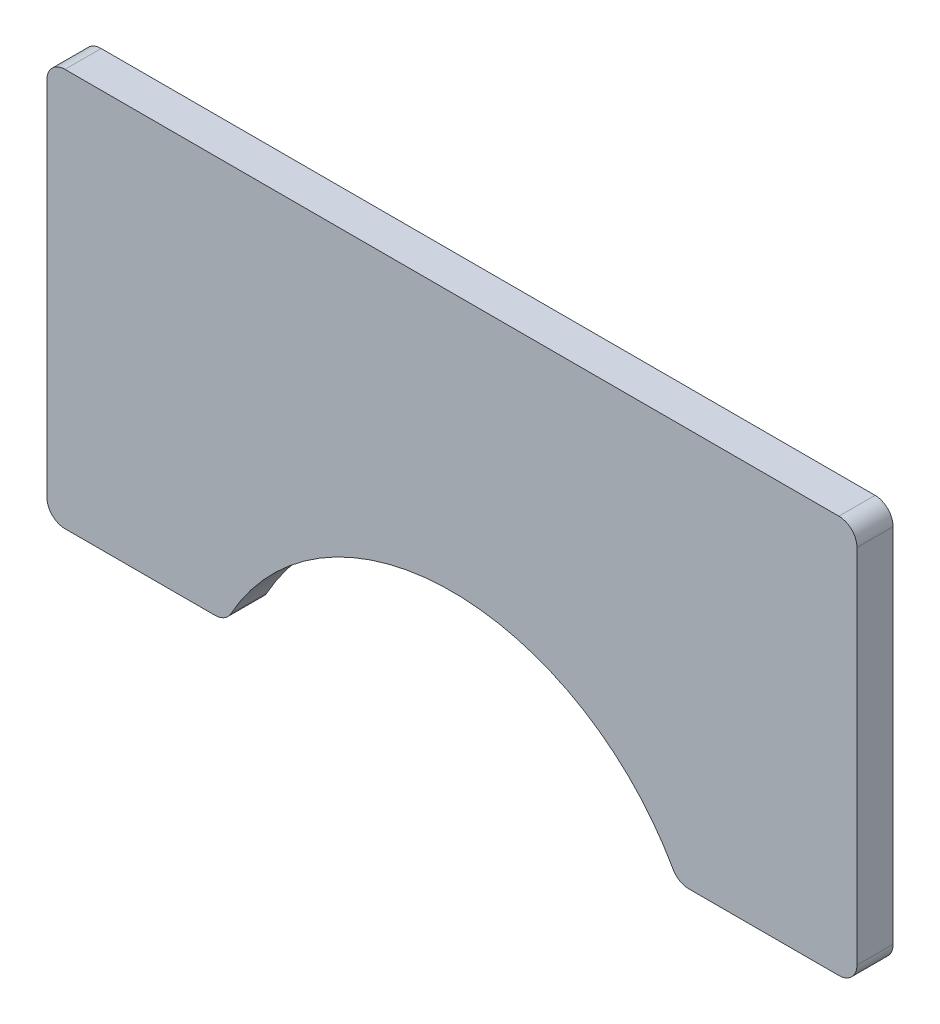
ISO-10303-21;
HEADER;
FILE_DESCRIPTION(('STEP AP214'),'2;1');
FILE_NAME('part.step','',(''),(''),'','','');
FILE_SCHEMA(('AUTOMOTIVE_DESIGN { 1 0 10303 214 1 1 1 1 }'));
ENDSEC;
DATA;
#1=APPLICATION_CONTEXT('core data for automotive mechanical design processes');
#2=APPLICATION_PROTOCOL_DEFINITION('international standard','automotive_design',2000,#1);
#3=PRODUCT_CONTEXT('',#1,'mechanical');
#4=PRODUCT('Part','Part','',(#3));
#5=PRODUCT_RELATED_PRODUCT_CATEGORY('part','',(#4));
#6=PRODUCT_DEFINITION_FORMATION('','',#4);
#7=PRODUCT_DEFINITION_CONTEXT('part definition',#1,'design');
#8=PRODUCT_DEFINITION('design','',#6,#7);
#9=PRODUCT_DEFINITION_SHAPE('','',#8);
#10=(LENGTH_UNIT() NAMED_UNIT(*) SI_UNIT(.MILLI.,.METRE.));
#11=(NAMED_UNIT(*) PLANE_ANGLE_UNIT() SI_UNIT($,.RADIAN.));
#12=(NAMED_UNIT(*) SI_UNIT($,.STERADIAN.) SOLID_ANGLE_UNIT());
#13=UNCERTAINTY_MEASURE_WITH_UNIT(LENGTH_MEASURE(1.E-05),#10,'distance_accuracy_value','');
#14=(GEOMETRIC_REPRESENTATION_CONTEXT(3) GLOBAL_UNCERTAINTY_ASSIGNED_CONTEXT((#13)) GLOBAL_UNIT_ASSIGNED_CONTEXT((#10,
#11,#12)) REPRESENTATION_CONTEXT('',''));
#15=CARTESIAN_POINT('',(0.,0.,0.));
#16=DIRECTION('',(0.,0.,1.));
#17=DIRECTION('',(1.,0.,0.));
#18=AXIS2_PLACEMENT_3D('',#15,#16,#17);
#19=CARTESIAN_POINT('',(-28.448,-13.97,2.54));
#20=DIRECTION('',(0.,1.,0.));
#21=DIRECTION('',(0.,0.,1.));
#22=AXIS2_PLACEMENT_3D('',#19,#20,#21);
#23=PLANE('',#22);
#24=DIRECTION('',(1.,0.,0.));
#25=VECTOR('',#24,1.);
#26=CARTESIAN_POINT('',(-28.448,-13.97,0.));
#27=LINE('',#26,#25);
#28=CARTESIAN_POINT('',(-27.178,-13.97,0.));
#29=VERTEX_POINT('',#28);
#30=CARTESIAN_POINT('',(-16.6384773897308,-13.97,0.));
#31=VERTEX_POINT('',#30);
#32=EDGE_CURVE('E170',#29,#31,#27,.T.);
#33=ORIENTED_EDGE('',*,*,#32,.T.);
#34=DIRECTION('',(0.,0.,1.));
#35=VECTOR('',#34,1.);
#36=CARTESIAN_POINT('',(-16.6384773897308,-13.97,2.54));
#37=LINE('',#36,#35);
#38=CARTESIAN_POINT('',(-16.6384773897308,-13.97,2.54));
#39=VERTEX_POINT('',#38);
#40=EDGE_CURVE('E213',#31,#39,#37,.T.);
#41=ORIENTED_EDGE('',*,*,#40,.T.);
#42=DIRECTION('',(1.,0.,0.));
#43=VECTOR('',#42,1.);
#44=CARTESIAN_POINT('',(-28.448,-13.97,2.54));
#45=LINE('',#44,#43);
#46=CARTESIAN_POINT('',(-27.178,-13.97,2.54));
#47=VERTEX_POINT('',#46);
#48=EDGE_CURVE('E178',#47,#39,#45,.T.);
#49=ORIENTED_EDGE('',*,*,#48,.F.);
#50=DIRECTION('',(0.,0.,-1.));
#51=VECTOR('',#50,1.);
#52=CARTESIAN_POINT('',(-27.178,-13.97,2.54));
#53=LINE('',#52,#51);
#54=EDGE_CURVE('E210',#47,#29,#53,.T.);
#55=ORIENTED_EDGE('',*,*,#54,.T.);
#56=EDGE_LOOP('',(#33,#41,#49,#55));
#57=FACE_BOUND('',#56,.T.);
#58=ADVANCED_FACE('F45',(#57),#23,.F.);
#59=CARTESIAN_POINT('',(28.448,-13.97,2.54));
#60=DIRECTION('',(-1.,0.,0.));
#61=DIRECTION('',(0.,0.,1.));
#62=AXIS2_PLACEMENT_3D('',#59,#60,#61);
#63=PLANE('',#62);
#64=DIRECTION('',(0.,1.,0.));
#65=VECTOR('',#64,1.);
#66=CARTESIAN_POINT('',(28.448,-13.97,2.54));
#67=LINE('',#66,#65);
#68=CARTESIAN_POINT('',(28.448,-12.7,2.54));
#69=VERTEX_POINT('',#68);
#70=CARTESIAN_POINT('',(28.448,12.7,2.54));
#71=VERTEX_POINT('',#70);
#72=EDGE_CURVE('E166',#69,#71,#67,.T.);
#73=ORIENTED_EDGE('',*,*,#72,.F.);
#74=DIRECTION('',(0.,0.,-1.));
#75=VECTOR('',#74,1.);
#76=CARTESIAN_POINT('',(28.448,-12.7,2.54));
#77=LINE('',#76,#75);
#78=CARTESIAN_POINT('',(28.448,-12.7,0.));
#79=VERTEX_POINT('',#78);
#80=EDGE_CURVE('E223',#69,#79,#77,.T.);
#81=ORIENTED_EDGE('',*,*,#80,.T.);
#82=DIRECTION('',(0.,1.,0.));
#83=VECTOR('',#82,1.);
#84=CARTESIAN_POINT('',(28.448,-13.97,0.));
#85=LINE('',#84,#83);
#86=CARTESIAN_POINT('',(28.448,12.7,0.));
#87=VERTEX_POINT('',#86);
#88=EDGE_CURVE('E163',#79,#87,#85,.T.);
#89=ORIENTED_EDGE('',*,*,#88,.T.);
#90=DIRECTION('',(0.,0.,-1.));
#91=VECTOR('',#90,1.);
#92=CARTESIAN_POINT('',(28.448,12.7,2.54));
#93=LINE('',#92,#91);
#94=EDGE_CURVE('E221',#87,#71,#93,.F.);
#95=ORIENTED_EDGE('',*,*,#94,.T.);
#96=EDGE_LOOP('',(#73,#81,#89,#95));
#97=FACE_BOUND('',#96,.T.);
#98=ADVANCED_FACE('F258',(#97),#63,.F.);
#99=CARTESIAN_POINT('',(-28.448,13.97,2.54));
#100=DIRECTION('',(0.,-1.,0.));
#101=DIRECTION('',(1.,0.,0.));
#102=AXIS2_PLACEMENT_3D('',#99,#100,#101);
#103=PLANE('',#102);
#104=DIRECTION('',(-1.,0.,0.));
#105=VECTOR('',#104,1.);
#106=CARTESIAN_POINT('',(-28.448,13.97,2.54));
#107=LINE('',#106,#105);
#108=CARTESIAN_POINT('',(27.178,13.97,2.54));
#109=VERTEX_POINT('',#108);
#110=CARTESIAN_POINT('',(-27.178,13.97,2.54));
#111=VERTEX_POINT('',#110);
#112=EDGE_CURVE('E169',#109,#111,#107,.T.);
#113=ORIENTED_EDGE('',*,*,#112,.F.);
#114=DIRECTION('',(0.,0.,-1.));
#115=VECTOR('',#114,1.);
#116=CARTESIAN_POINT('',(27.178,13.97,2.54));
#117=LINE('',#116,#115);
#118=CARTESIAN_POINT('',(27.178,13.97,0.));
#119=VERTEX_POINT('',#118);
#120=EDGE_CURVE('E11',#109,#119,#117,.T.);
#121=ORIENTED_EDGE('',*,*,#120,.T.);
#122=DIRECTION('',(-1.,0.,0.));
#123=VECTOR('',#122,1.);
#124=CARTESIAN_POINT('',(-28.448,13.97,0.));
#125=LINE('',#124,#123);
#126=CARTESIAN_POINT('',(-27.178,13.97,0.));
#127=VERTEX_POINT('',#126);
#128=EDGE_CURVE('E180',#119,#127,#125,.T.);
#129=ORIENTED_EDGE('',*,*,#128,.T.);
#130=DIRECTION('',(0.,0.,-1.));
#131=VECTOR('',#130,1.);
#132=CARTESIAN_POINT('',(-27.178,13.97,2.54));
#133=LINE('',#132,#131);
#134=EDGE_CURVE('E53',#127,#111,#133,.F.);
#135=ORIENTED_EDGE('',*,*,#134,.T.);
#136=EDGE_LOOP('',(#113,#121,#129,#135));
#137=FACE_BOUND('',#136,.T.);
#138=ADVANCED_FACE('F227',(#137),#103,.F.);
#139=CARTESIAN_POINT('',(-28.448,-13.97,2.54));
#140=DIRECTION('',(1.,0.,0.));
#141=DIRECTION('',(0.,0.,-1.));
#142=AXIS2_PLACEMENT_3D('',#139,#140,#141);
#143=PLANE('',#142);
#144=DIRECTION('',(0.,-1.,0.));
#145=VECTOR('',#144,1.);
#146=CARTESIAN_POINT('',(-28.448,-13.97,0.));
#147=LINE('',#146,#145);
#148=CARTESIAN_POINT('',(-28.448,12.7,0.));
#149=VERTEX_POINT('',#148);
#150=CARTESIAN_POINT('',(-28.448,-12.7,0.));
#151=VERTEX_POINT('',#150);
#152=EDGE_CURVE('E183',#149,#151,#147,.T.);
#153=ORIENTED_EDGE('',*,*,#152,.T.);
#154=DIRECTION('',(0.,0.,-1.));
#155=VECTOR('',#154,1.);
#156=CARTESIAN_POINT('',(-28.448,-12.7,2.54));
#157=LINE('',#156,#155);
#158=CARTESIAN_POINT('',(-28.448,-12.7,2.54));
#159=VERTEX_POINT('',#158);
#160=EDGE_CURVE('E219',#151,#159,#157,.F.);
#161=ORIENTED_EDGE('',*,*,#160,.T.);
#162=DIRECTION('',(0.,-1.,0.));
#163=VECTOR('',#162,1.);
#164=CARTESIAN_POINT('',(-28.448,-13.97,2.54));
#165=LINE('',#164,#163);
#166=CARTESIAN_POINT('',(-28.448,12.7,2.54));
#167=VERTEX_POINT('',#166);
#168=EDGE_CURVE('E173',#167,#159,#165,.T.);
#169=ORIENTED_EDGE('',*,*,#168,.F.);
#170=DIRECTION('',(0.,0.,-1.));
#171=VECTOR('',#170,1.);
#172=CARTESIAN_POINT('',(-28.448,12.7,2.54));
#173=LINE('',#172,#171);
#174=EDGE_CURVE('E216',#167,#149,#173,.T.);
#175=ORIENTED_EDGE('',*,*,#174,.T.);
#176=EDGE_LOOP('',(#153,#161,#169,#175));
#177=FACE_BOUND('',#176,.T.);
#178=ADVANCED_FACE('F236',(#177),#143,.F.);
#179=CARTESIAN_POINT('',(16.6384773897308,-13.97,2.54));
#180=VERTEX_POINT('',#179);
#181=CARTESIAN_POINT('',(27.178,-13.97,2.54));
#182=VERTEX_POINT('',#181);
#183=EDGE_CURVE('E176',#180,#182,#45,.T.);
#184=ORIENTED_EDGE('',*,*,#183,.F.);
#185=DIRECTION('',(0.,0.,1.));
#186=VECTOR('',#185,1.);
#187=CARTESIAN_POINT('',(16.6384773897308,-13.97,2.54));
#188=LINE('',#187,#186);
#189=CARTESIAN_POINT('',(16.6384773897308,-13.97,0.));
#190=VERTEX_POINT('',#189);
#191=EDGE_CURVE('E141',#180,#190,#188,.F.);
#192=ORIENTED_EDGE('',*,*,#191,.T.);
#193=CARTESIAN_POINT('',(27.178,-13.97,0.));
#194=VERTEX_POINT('',#193);
#195=EDGE_CURVE('E186',#190,#194,#27,.T.);
#196=ORIENTED_EDGE('',*,*,#195,.T.);
#197=DIRECTION('',(0.,0.,-1.));
#198=VECTOR('',#197,1.);
#199=CARTESIAN_POINT('',(27.178,-13.97,2.54));
#200=LINE('',#199,#198);
#201=EDGE_CURVE('E146',#194,#182,#200,.F.);
#202=ORIENTED_EDGE('',*,*,#201,.T.);
#203=EDGE_LOOP('',(#184,#192,#196,#202));
#204=FACE_BOUND('',#203,.T.);
#205=ADVANCED_FACE('F253',(#204),#23,.F.);
#206=CARTESIAN_POINT('',(0.,0.,2.54));
#207=DIRECTION('',(0.,0.,-1.));
#208=DIRECTION('',(-1.,0.,0.));
#209=AXIS2_PLACEMENT_3D('',#206,#207,#208);
#210=PLANE('',#209);
#211=CARTESIAN_POINT('',(0.,-21.9770453352032,2.54));
#212=DIRECTION('',(0.,0.,1.));
#213=DIRECTION('',(-1.,0.,0.));
#214=AXIS2_PLACEMENT_3D('',#211,#212,#213);
#215=CIRCLE('',#214,17.78);
#216=CARTESIAN_POINT('',(15.5292455637488,-13.3184696890136,2.54));
#217=VERTEX_POINT('',#216);
#218=CARTESIAN_POINT('',(-15.5292455637488,-13.3184696890136,2.54));
#219=VERTEX_POINT('',#218);
#220=EDGE_CURVE('E153',#217,#219,#215,.T.);
#221=ORIENTED_EDGE('',*,*,#220,.F.);
#222=CARTESIAN_POINT('',(16.6384773897308,-12.7,2.54));
#223=DIRECTION('',(0.,0.,-1.));
#224=DIRECTION('',(-1.,0.,0.));
#225=AXIS2_PLACEMENT_3D('',#222,#223,#224);
#226=CIRCLE('',#225,1.27);
#227=EDGE_CURVE('E136',#217,#180,#226,.F.);
#228=ORIENTED_EDGE('',*,*,#227,.T.);
#229=ORIENTED_EDGE('',*,*,#183,.T.);
#230=CARTESIAN_POINT('',(27.178,-12.7,2.54));
#231=DIRECTION('',(0.,0.,-1.));
#232=DIRECTION('',(-1.,0.,0.));
#233=AXIS2_PLACEMENT_3D('',#230,#231,#232);
#234=CIRCLE('',#233,1.27);
#235=EDGE_CURVE('E193',#182,#69,#234,.F.);
#236=ORIENTED_EDGE('',*,*,#235,.T.);
#237=ORIENTED_EDGE('',*,*,#72,.T.);
#238=CARTESIAN_POINT('',(27.178,12.7,2.54));
#239=DIRECTION('',(0.,0.,-1.));
#240=DIRECTION('',(-1.,0.,0.));
#241=AXIS2_PLACEMENT_3D('',#238,#239,#240);
#242=CIRCLE('',#241,1.27);
#243=EDGE_CURVE('E191',#71,#109,#242,.F.);
#244=ORIENTED_EDGE('',*,*,#243,.T.);
#245=ORIENTED_EDGE('',*,*,#112,.T.);
#246=CARTESIAN_POINT('',(-27.178,12.7,2.54));
#247=DIRECTION('',(0.,0.,-1.));
#248=DIRECTION('',(-1.,0.,0.));
#249=AXIS2_PLACEMENT_3D('',#246,#247,#248);
#250=CIRCLE('',#249,1.27);
#251=EDGE_CURVE('E157',#111,#167,#250,.F.);
#252=ORIENTED_EDGE('',*,*,#251,.T.);
#253=ORIENTED_EDGE('',*,*,#168,.T.);
#254=CARTESIAN_POINT('',(-27.178,-12.7,2.54));
#255=DIRECTION('',(0.,0.,-1.));
#256=DIRECTION('',(-1.,0.,0.));
#257=AXIS2_PLACEMENT_3D('',#254,#255,#256);
#258=CIRCLE('',#257,1.27);
#259=EDGE_CURVE('E195',#159,#47,#258,.F.);
#260=ORIENTED_EDGE('',*,*,#259,.T.);
#261=ORIENTED_EDGE('',*,*,#48,.T.);
#262=CARTESIAN_POINT('',(-16.6384773897308,-12.7,2.54));
#263=DIRECTION('',(0.,0.,-1.));
#264=DIRECTION('',(-1.,0.,0.));
#265=AXIS2_PLACEMENT_3D('',#262,#263,#264);
#266=CIRCLE('',#265,1.27);
#267=EDGE_CURVE('E147',#39,#219,#266,.F.);
#268=ORIENTED_EDGE('',*,*,#267,.T.);
#269=EDGE_LOOP('',(#221,#228,#229,#236,#237,#244,#245,#252,#253,#260,#261,#268));
#270=FACE_BOUND('',#269,.T.);
#271=ADVANCED_FACE('F160',(#270),#210,.F.);
#272=CARTESIAN_POINT('',(0.,0.,0.));
#273=DIRECTION('',(0.,0.,-1.));
#274=DIRECTION('',(-1.,0.,0.));
#275=AXIS2_PLACEMENT_3D('',#272,#273,#274);
#276=PLANE('',#275);
#277=ORIENTED_EDGE('',*,*,#195,.F.);
#278=CARTESIAN_POINT('',(16.6384773897308,-12.7,0.));
#279=DIRECTION('',(0.,0.,-1.));
#280=DIRECTION('',(-1.,0.,0.));
#281=AXIS2_PLACEMENT_3D('',#278,#279,#280);
#282=CIRCLE('',#281,1.27);
#283=CARTESIAN_POINT('',(15.5292455637488,-13.3184696890136,0.));
#284=VERTEX_POINT('',#283);
#285=EDGE_CURVE('E208',#190,#284,#282,.T.);
#286=ORIENTED_EDGE('',*,*,#285,.T.);
#287=CARTESIAN_POINT('',(0.,-21.9770453352032,0.));
#288=DIRECTION('',(0.,0.,1.));
#289=DIRECTION('',(-1.,0.,0.));
#290=AXIS2_PLACEMENT_3D('',#287,#288,#289);
#291=CIRCLE('',#290,17.78);
#292=CARTESIAN_POINT('',(-15.5292455637488,-13.3184696890136,0.));
#293=VERTEX_POINT('',#292);
#294=EDGE_CURVE('E156',#284,#293,#291,.T.);
#295=ORIENTED_EDGE('',*,*,#294,.T.);
#296=CARTESIAN_POINT('',(-16.6384773897308,-12.7,0.));
#297=DIRECTION('',(0.,0.,-1.));
#298=DIRECTION('',(-1.,0.,0.));
#299=AXIS2_PLACEMENT_3D('',#296,#297,#298);
#300=CIRCLE('',#299,1.27);
#301=EDGE_CURVE('E206',#293,#31,#300,.T.);
#302=ORIENTED_EDGE('',*,*,#301,.T.);
#303=ORIENTED_EDGE('',*,*,#32,.F.);
#304=CARTESIAN_POINT('',(-27.178,-12.7,0.));
#305=DIRECTION('',(0.,0.,-1.));
#306=DIRECTION('',(-1.,0.,0.));
#307=AXIS2_PLACEMENT_3D('',#304,#305,#306);
#308=CIRCLE('',#307,1.27);
#309=EDGE_CURVE('E204',#29,#151,#308,.T.);
#310=ORIENTED_EDGE('',*,*,#309,.T.);
#311=ORIENTED_EDGE('',*,*,#152,.F.);
#312=CARTESIAN_POINT('',(-27.178,12.7,0.));
#313=DIRECTION('',(0.,0.,-1.));
#314=DIRECTION('',(-1.,0.,0.));
#315=AXIS2_PLACEMENT_3D('',#312,#313,#314);
#316=CIRCLE('',#315,1.27);
#317=EDGE_CURVE('E200',#149,#127,#316,.T.);
#318=ORIENTED_EDGE('',*,*,#317,.T.);
#319=ORIENTED_EDGE('',*,*,#128,.F.);
#320=CARTESIAN_POINT('',(27.178,12.7,0.));
#321=DIRECTION('',(0.,0.,-1.));
#322=DIRECTION('',(-1.,0.,0.));
#323=AXIS2_PLACEMENT_3D('',#320,#321,#322);
#324=CIRCLE('',#323,1.27);
#325=EDGE_CURVE('E60',#119,#87,#324,.T.);
#326=ORIENTED_EDGE('',*,*,#325,.T.);
#327=ORIENTED_EDGE('',*,*,#88,.F.);
#328=CARTESIAN_POINT('',(27.178,-12.7,0.));
#329=DIRECTION('',(0.,0.,-1.));
#330=DIRECTION('',(-1.,0.,0.));
#331=AXIS2_PLACEMENT_3D('',#328,#329,#330);
#332=CIRCLE('',#331,1.27);
#333=EDGE_CURVE('E68',#79,#194,#332,.T.);
#334=ORIENTED_EDGE('',*,*,#333,.T.);
#335=EDGE_LOOP('',(#277,#286,#295,#302,#303,#310,#311,#318,#319,#326,#327,#334));
#336=FACE_BOUND('',#335,.T.);
#337=ADVANCED_FACE('F239',(#336),#276,.T.);
#338=CARTESIAN_POINT('',(0.,-21.9770453352032,0.));
#339=DIRECTION('',(0.,0.,1.));
#340=DIRECTION('',(1.,0.,0.));
#341=AXIS2_PLACEMENT_3D('',#338,#339,#340);
#342=CYLINDRICAL_SURFACE('',#341,17.78);
#343=ORIENTED_EDGE('',*,*,#294,.F.);
#344=DIRECTION('',(0.,0.,1.));
#345=VECTOR('',#344,1.);
#346=CARTESIAN_POINT('',(15.5292455637488,-13.3184696890136,0.));
#347=LINE('',#346,#345);
#348=EDGE_CURVE('E140',#284,#217,#347,.T.);
#349=ORIENTED_EDGE('',*,*,#348,.T.);
#350=ORIENTED_EDGE('',*,*,#220,.T.);
#351=DIRECTION('',(0.,0.,1.));
#352=VECTOR('',#351,1.);
#353=CARTESIAN_POINT('',(-15.5292455637488,-13.3184696890136,0.));
#354=LINE('',#353,#352);
#355=EDGE_CURVE('E158',#219,#293,#354,.F.);
#356=ORIENTED_EDGE('',*,*,#355,.T.);
#357=EDGE_LOOP('',(#343,#349,#350,#356));
#358=FACE_BOUND('',#357,.T.);
#359=ADVANCED_FACE('F152',(#358),#342,.F.);
#360=CARTESIAN_POINT('',(16.6384773897308,-12.7,0.));
#361=DIRECTION('',(0.,0.,1.));
#362=DIRECTION('',(1.,0.,0.));
#363=AXIS2_PLACEMENT_3D('',#360,#361,#362);
#364=CYLINDRICAL_SURFACE('',#363,1.27);
#365=ORIENTED_EDGE('',*,*,#285,.F.);
#366=ORIENTED_EDGE('',*,*,#191,.F.);
#367=ORIENTED_EDGE('',*,*,#227,.F.);
#368=ORIENTED_EDGE('',*,*,#348,.F.);
#369=EDGE_LOOP('',(#365,#366,#367,#368));
#370=FACE_BOUND('',#369,.T.);
#371=ADVANCED_FACE('F139',(#370),#364,.T.);
#372=CARTESIAN_POINT('',(-16.6384773897308,-12.7,0.));
#373=DIRECTION('',(0.,0.,1.));
#374=DIRECTION('',(1.,0.,0.));
#375=AXIS2_PLACEMENT_3D('',#372,#373,#374);
#376=CYLINDRICAL_SURFACE('',#375,1.27);
#377=ORIENTED_EDGE('',*,*,#301,.F.);
#378=ORIENTED_EDGE('',*,*,#355,.F.);
#379=ORIENTED_EDGE('',*,*,#267,.F.);
#380=ORIENTED_EDGE('',*,*,#40,.F.);
#381=EDGE_LOOP('',(#377,#378,#379,#380));
#382=FACE_BOUND('',#381,.T.);
#383=ADVANCED_FACE('F250',(#382),#376,.T.);
#384=CARTESIAN_POINT('',(-27.178,-12.7,2.54));
#385=DIRECTION('',(0.,0.,-1.));
#386=DIRECTION('',(-1.,0.,0.));
#387=AXIS2_PLACEMENT_3D('',#384,#385,#386);
#388=CYLINDRICAL_SURFACE('',#387,1.27);
#389=ORIENTED_EDGE('',*,*,#259,.F.);
#390=ORIENTED_EDGE('',*,*,#160,.F.);
#391=ORIENTED_EDGE('',*,*,#309,.F.);
#392=ORIENTED_EDGE('',*,*,#54,.F.);
#393=EDGE_LOOP('',(#389,#390,#391,#392));
#394=FACE_BOUND('',#393,.T.);
#395=ADVANCED_FACE('F244',(#394),#388,.T.);
#396=CARTESIAN_POINT('',(27.178,-12.7,2.54));
#397=DIRECTION('',(0.,0.,-1.));
#398=DIRECTION('',(-1.,0.,0.));
#399=AXIS2_PLACEMENT_3D('',#396,#397,#398);
#400=CYLINDRICAL_SURFACE('',#399,1.27);
#401=ORIENTED_EDGE('',*,*,#235,.F.);
#402=ORIENTED_EDGE('',*,*,#201,.F.);
#403=ORIENTED_EDGE('',*,*,#333,.F.);
#404=ORIENTED_EDGE('',*,*,#80,.F.);
#405=EDGE_LOOP('',(#401,#402,#403,#404));
#406=FACE_BOUND('',#405,.T.);
#407=ADVANCED_FACE('F255',(#406),#400,.T.);
#408=CARTESIAN_POINT('',(27.178,12.7,2.54));
#409=DIRECTION('',(0.,0.,-1.));
#410=DIRECTION('',(-1.,0.,0.));
#411=AXIS2_PLACEMENT_3D('',#408,#409,#410);
#412=CYLINDRICAL_SURFACE('',#411,1.27);
#413=ORIENTED_EDGE('',*,*,#243,.F.);
#414=ORIENTED_EDGE('',*,*,#94,.F.);
#415=ORIENTED_EDGE('',*,*,#325,.F.);
#416=ORIENTED_EDGE('',*,*,#120,.F.);
#417=EDGE_LOOP('',(#413,#414,#415,#416));
#418=FACE_BOUND('',#417,.T.);
#419=ADVANCED_FACE('F261',(#418),#412,.T.);
#420=CARTESIAN_POINT('',(-27.178,12.7,2.54));
#421=DIRECTION('',(0.,0.,-1.));
#422=DIRECTION('',(-1.,0.,0.));
#423=AXIS2_PLACEMENT_3D('',#420,#421,#422);
#424=CYLINDRICAL_SURFACE('',#423,1.27);
#425=ORIENTED_EDGE('',*,*,#251,.F.);
#426=ORIENTED_EDGE('',*,*,#134,.F.);
#427=ORIENTED_EDGE('',*,*,#317,.F.);
#428=ORIENTED_EDGE('',*,*,#174,.F.);
#429=EDGE_LOOP('',(#425,#426,#427,#428));
#430=FACE_BOUND('',#429,.T.);
#431=ADVANCED_FACE('F47',(#430),#424,.T.);
#432=CLOSED_SHELL('',(#58,#98,#138,#178,#205,#271,#337,#359,#371,#383,#395,#407,#419,#431));
#433=MANIFOLD_SOLID_BREP('B2',#432);
#434=ADVANCED_BREP_SHAPE_REPRESENTATION('',(#18,#433),#14);
#435=SHAPE_DEFINITION_REPRESENTATION(#9,#434);
ENDSEC;
END-ISO-10303-21;
